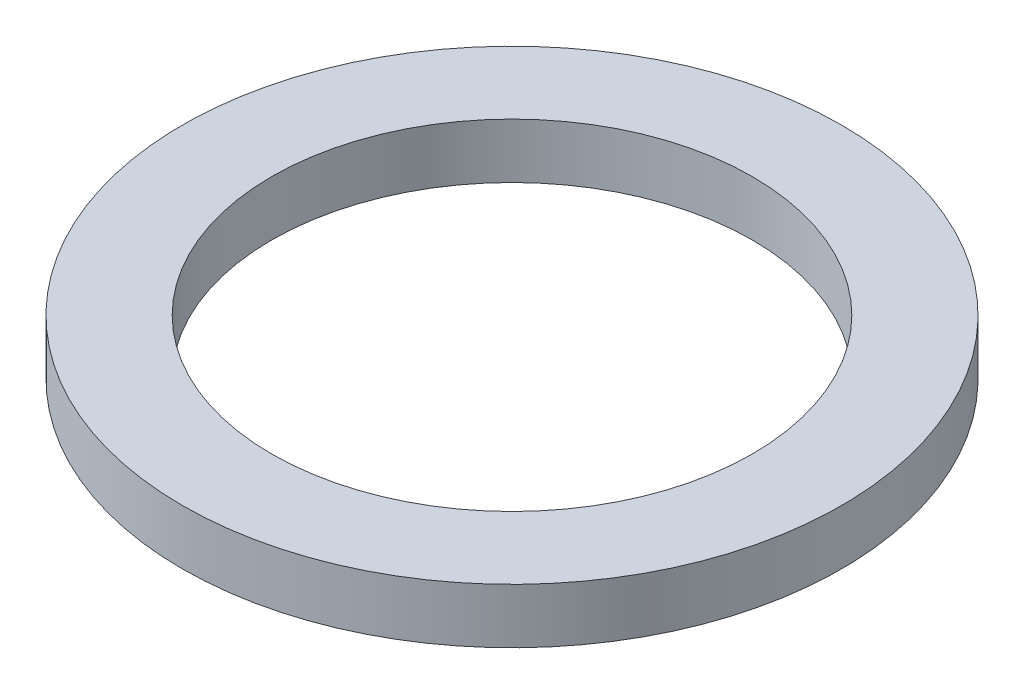
ISO-10303-21;
HEADER;
FILE_DESCRIPTION(('STEP AP214'),'2;1');
FILE_NAME('part.step','',(''),(''),'','','');
FILE_SCHEMA(('AUTOMOTIVE_DESIGN { 1 0 10303 214 1 1 1 1 }'));
ENDSEC;
DATA;
#1=APPLICATION_CONTEXT('core data for automotive mechanical design processes');
#2=APPLICATION_PROTOCOL_DEFINITION('international standard','automotive_design',2000,#1);
#3=PRODUCT_CONTEXT('',#1,'mechanical');
#4=PRODUCT('Part','Part','',(#3));
#5=PRODUCT_RELATED_PRODUCT_CATEGORY('part','',(#4));
#6=PRODUCT_DEFINITION_FORMATION('','',#4);
#7=PRODUCT_DEFINITION_CONTEXT('part definition',#1,'design');
#8=PRODUCT_DEFINITION('design','',#6,#7);
#9=PRODUCT_DEFINITION_SHAPE('','',#8);
#10=(LENGTH_UNIT() NAMED_UNIT(*) SI_UNIT(.MILLI.,.METRE.));
#11=(NAMED_UNIT(*) PLANE_ANGLE_UNIT() SI_UNIT($,.RADIAN.));
#12=(NAMED_UNIT(*) SI_UNIT($,.STERADIAN.) SOLID_ANGLE_UNIT());
#13=UNCERTAINTY_MEASURE_WITH_UNIT(LENGTH_MEASURE(1.E-05),#10,'distance_accuracy_value','');
#14=(GEOMETRIC_REPRESENTATION_CONTEXT(3) GLOBAL_UNCERTAINTY_ASSIGNED_CONTEXT((#13)) GLOBAL_UNIT_ASSIGNED_CONTEXT((#10,
#11,#12)) REPRESENTATION_CONTEXT('',''));
#15=CARTESIAN_POINT('',(0.,0.,0.));
#16=DIRECTION('',(0.,0.,1.));
#17=DIRECTION('',(1.,0.,0.));
#18=AXIS2_PLACEMENT_3D('',#15,#16,#17);
#19=CARTESIAN_POINT('',(0.,12.7,0.));
#20=DIRECTION('',(0.,1.,0.));
#21=DIRECTION('',(0.,0.,1.));
#22=AXIS2_PLACEMENT_3D('',#19,#20,#21);
#23=PLANE('',#22);
#24=CARTESIAN_POINT('',(0.,12.7,0.));
#25=DIRECTION('',(0.,1.,0.));
#26=DIRECTION('',(0.,0.,1.));
#27=AXIS2_PLACEMENT_3D('',#24,#25,#26);
#28=CIRCLE('',#27,76.2);
#29=CARTESIAN_POINT('',(0.,12.7,76.2));
#30=VERTEX_POINT('',#29);
#31=EDGE_CURVE('E10',#30,#30,#28,.T.);
#32=ORIENTED_EDGE('',*,*,#31,.T.);
#33=EDGE_LOOP('',(#32));
#34=FACE_BOUND('',#33,.T.);
#35=CARTESIAN_POINT('',(0.,12.7,0.));
#36=DIRECTION('',(0.,1.,0.));
#37=DIRECTION('',(0.,0.,1.));
#38=AXIS2_PLACEMENT_3D('',#35,#36,#37);
#39=CIRCLE('',#38,55.5625);
#40=CARTESIAN_POINT('',(0.,12.7,55.5625));
#41=VERTEX_POINT('',#40);
#42=EDGE_CURVE('E50',#41,#41,#39,.T.);
#43=ORIENTED_EDGE('',*,*,#42,.F.);
#44=EDGE_LOOP('',(#43));
#45=FACE_BOUND('',#44,.T.);
#46=ADVANCED_FACE('F37',(#34,#45),#23,.T.);
#47=CARTESIAN_POINT('',(0.,0.,0.));
#48=DIRECTION('',(0.,1.,0.));
#49=DIRECTION('',(0.,0.,1.));
#50=AXIS2_PLACEMENT_3D('',#47,#48,#49);
#51=PLANE('',#50);
#52=CARTESIAN_POINT('',(0.,0.,0.));
#53=DIRECTION('',(0.,1.,0.));
#54=DIRECTION('',(0.,0.,1.));
#55=AXIS2_PLACEMENT_3D('',#52,#53,#54);
#56=CIRCLE('',#55,76.2);
#57=CARTESIAN_POINT('',(0.,0.,76.2));
#58=VERTEX_POINT('',#57);
#59=EDGE_CURVE('E41',#58,#58,#56,.T.);
#60=ORIENTED_EDGE('',*,*,#59,.F.);
#61=EDGE_LOOP('',(#60));
#62=FACE_BOUND('',#61,.T.);
#63=CARTESIAN_POINT('',(0.,0.,0.));
#64=DIRECTION('',(0.,1.,0.));
#65=DIRECTION('',(0.,0.,1.));
#66=AXIS2_PLACEMENT_3D('',#63,#64,#65);
#67=CIRCLE('',#66,55.5625);
#68=CARTESIAN_POINT('',(0.,0.,55.5625));
#69=VERTEX_POINT('',#68);
#70=EDGE_CURVE('E52',#69,#69,#67,.T.);
#71=ORIENTED_EDGE('',*,*,#70,.T.);
#72=EDGE_LOOP('',(#71));
#73=FACE_BOUND('',#72,.T.);
#74=ADVANCED_FACE('F64',(#62,#73),#51,.F.);
#75=CARTESIAN_POINT('',(0.,12.7,0.));
#76=DIRECTION('',(0.,-1.,0.));
#77=DIRECTION('',(0.,0.,-1.));
#78=AXIS2_PLACEMENT_3D('',#75,#76,#77);
#79=CYLINDRICAL_SURFACE('',#78,76.2);
#80=ORIENTED_EDGE('',*,*,#31,.F.);
#81=EDGE_LOOP('',(#80));
#82=FACE_BOUND('',#81,.T.);
#83=ORIENTED_EDGE('',*,*,#59,.T.);
#84=EDGE_LOOP('',(#83));
#85=FACE_BOUND('',#84,.T.);
#86=ADVANCED_FACE('F39',(#82,#85),#79,.T.);
#87=CARTESIAN_POINT('',(0.,12.7,0.));
#88=DIRECTION('',(0.,-1.,0.));
#89=DIRECTION('',(0.,0.,-1.));
#90=AXIS2_PLACEMENT_3D('',#87,#88,#89);
#91=CYLINDRICAL_SURFACE('',#90,55.5625);
#92=ORIENTED_EDGE('',*,*,#42,.T.);
#93=EDGE_LOOP('',(#92));
#94=FACE_BOUND('',#93,.T.);
#95=ORIENTED_EDGE('',*,*,#70,.F.);
#96=EDGE_LOOP('',(#95));
#97=FACE_BOUND('',#96,.T.);
#98=ADVANCED_FACE('F60',(#94,#97),#91,.F.);
#99=CLOSED_SHELL('',(#46,#74,#86,#98));
#100=MANIFOLD_SOLID_BREP('B2',#99);
#101=ADVANCED_BREP_SHAPE_REPRESENTATION('',(#18,#100),#14);
#102=SHAPE_DEFINITION_REPRESENTATION(#9,#101);
ENDSEC;
END-ISO-10303-21;
